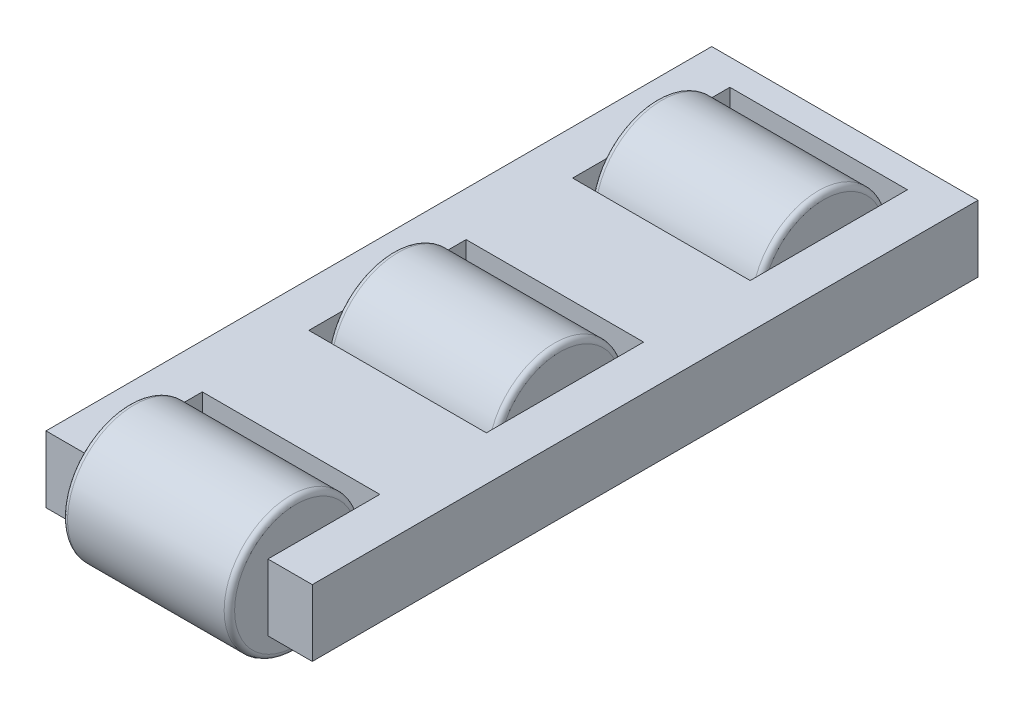
ISO-10303-21;
HEADER;
FILE_DESCRIPTION(('STEP AP214'),'2;1');
FILE_NAME('part.step','',(''),(''),'','','');
FILE_SCHEMA(('AUTOMOTIVE_DESIGN { 1 0 10303 214 1 1 1 1 }'));
ENDSEC;
DATA;
#1=APPLICATION_CONTEXT('core data for automotive mechanical design processes');
#2=APPLICATION_PROTOCOL_DEFINITION('international standard','automotive_design',2000,#1);
#3=PRODUCT_CONTEXT('',#1,'mechanical');
#4=PRODUCT('Part','Part','',(#3));
#5=PRODUCT_RELATED_PRODUCT_CATEGORY('part','',(#4));
#6=PRODUCT_DEFINITION_FORMATION('','',#4);
#7=PRODUCT_DEFINITION_CONTEXT('part definition',#1,'design');
#8=PRODUCT_DEFINITION('design','',#6,#7);
#9=PRODUCT_DEFINITION_SHAPE('','',#8);
#10=(LENGTH_UNIT() NAMED_UNIT(*) SI_UNIT(.MILLI.,.METRE.));
#11=(NAMED_UNIT(*) PLANE_ANGLE_UNIT() SI_UNIT($,.RADIAN.));
#12=(NAMED_UNIT(*) SI_UNIT($,.STERADIAN.) SOLID_ANGLE_UNIT());
#13=UNCERTAINTY_MEASURE_WITH_UNIT(LENGTH_MEASURE(1.E-05),#10,'distance_accuracy_value','');
#14=(GEOMETRIC_REPRESENTATION_CONTEXT(3) GLOBAL_UNCERTAINTY_ASSIGNED_CONTEXT((#13)) GLOBAL_UNIT_ASSIGNED_CONTEXT((#10,
#11,#12)) REPRESENTATION_CONTEXT('',''));
#15=CARTESIAN_POINT('',(0.,0.,0.));
#16=DIRECTION('',(0.,0.,1.));
#17=DIRECTION('',(1.,0.,0.));
#18=AXIS2_PLACEMENT_3D('',#15,#16,#17);
#19=CARTESIAN_POINT('',(15.9333333333333,6.35,57.15));
#20=DIRECTION('',(-1.,0.,0.));
#21=DIRECTION('',(0.,0.,1.));
#22=AXIS2_PLACEMENT_3D('',#19,#20,#21);
#23=PLANE('',#22);
#24=CARTESIAN_POINT('',(15.9333333333333,6.35,57.15));
#25=DIRECTION('',(-1.,0.,0.));
#26=DIRECTION('',(0.,0.,1.));
#27=AXIS2_PLACEMENT_3D('',#24,#25,#26);
#28=CIRCLE('',#27,11.7);
#29=CARTESIAN_POINT('',(15.9333333333333,6.35,68.85));
#30=VERTEX_POINT('',#29);
#31=EDGE_CURVE('E64',#30,#30,#28,.F.);
#32=ORIENTED_EDGE('',*,*,#31,.T.);
#33=EDGE_LOOP('',(#32));
#34=FACE_BOUND('',#33,.T.);
#35=ADVANCED_FACE('F57',(#34),#23,.F.);
#36=CARTESIAN_POINT('',(-51.85435781761,6.35,57.15));
#37=DIRECTION('',(1.,0.,0.));
#38=DIRECTION('',(0.,0.,-1.));
#39=AXIS2_PLACEMENT_3D('',#36,#37,#38);
#40=CYLINDRICAL_SURFACE('',#39,12.7);
#41=CARTESIAN_POINT('',(14.9333333333333,6.35,57.15));
#42=DIRECTION('',(-1.,0.,0.));
#43=DIRECTION('',(0.,0.,1.));
#44=AXIS2_PLACEMENT_3D('',#41,#42,#43);
#45=CIRCLE('',#44,12.7);
#46=CARTESIAN_POINT('',(14.9333333333333,6.35,69.85));
#47=VERTEX_POINT('',#46);
#48=EDGE_CURVE('E68',#47,#47,#45,.T.);
#49=ORIENTED_EDGE('',*,*,#48,.T.);
#50=EDGE_LOOP('',(#49));
#51=FACE_BOUND('',#50,.T.);
#52=CARTESIAN_POINT('',(-14.9333333333333,6.35,57.15));
#53=DIRECTION('',(1.,0.,0.));
#54=DIRECTION('',(0.,0.,-1.));
#55=AXIS2_PLACEMENT_3D('',#52,#53,#54);
#56=CIRCLE('',#55,12.7);
#57=CARTESIAN_POINT('',(-14.9333333333333,6.35,44.45));
#58=VERTEX_POINT('',#57);
#59=EDGE_CURVE('E72',#58,#58,#56,.T.);
#60=ORIENTED_EDGE('',*,*,#59,.T.);
#61=EDGE_LOOP('',(#60));
#62=FACE_BOUND('',#61,.T.);
#63=ADVANCED_FACE('F78',(#51,#62),#40,.T.);
#64=CARTESIAN_POINT('',(-15.9333333333333,0.,0.));
#65=DIRECTION('',(1.,0.,0.));
#66=DIRECTION('',(0.,0.,-1.));
#67=AXIS2_PLACEMENT_3D('',#64,#65,#66);
#68=PLANE('',#67);
#69=CARTESIAN_POINT('',(-15.9333333333333,6.35,57.15));
#70=DIRECTION('',(1.,0.,0.));
#71=DIRECTION('',(0.,0.,-1.));
#72=AXIS2_PLACEMENT_3D('',#69,#70,#71);
#73=CIRCLE('',#72,11.7);
#74=CARTESIAN_POINT('',(-15.9333333333333,6.35,45.45));
#75=VERTEX_POINT('',#74);
#76=EDGE_CURVE('E13',#75,#75,#73,.F.);
#77=ORIENTED_EDGE('',*,*,#76,.T.);
#78=EDGE_LOOP('',(#77));
#79=FACE_BOUND('',#78,.T.);
#80=ADVANCED_FACE('F86',(#79),#68,.F.);
#81=CARTESIAN_POINT('',(14.9333333333333,6.35,57.15));
#82=DIRECTION('',(-1.,0.,0.));
#83=DIRECTION('',(0.,0.,1.));
#84=AXIS2_PLACEMENT_3D('',#81,#82,#83);
#85=TOROIDAL_SURFACE('',#84,11.7,1.);
#86=ORIENTED_EDGE('',*,*,#31,.F.);
#87=EDGE_LOOP('',(#86));
#88=FACE_BOUND('',#87,.T.);
#89=ORIENTED_EDGE('',*,*,#48,.F.);
#90=EDGE_LOOP('',(#89));
#91=FACE_BOUND('',#90,.T.);
#92=ADVANCED_FACE('F81',(#88,#91),#85,.T.);
#93=CARTESIAN_POINT('',(-14.9333333333333,6.35,57.15));
#94=DIRECTION('',(1.,0.,0.));
#95=DIRECTION('',(0.,0.,-1.));
#96=AXIS2_PLACEMENT_3D('',#93,#94,#95);
#97=TOROIDAL_SURFACE('',#96,11.7,1.);
#98=ORIENTED_EDGE('',*,*,#76,.F.);
#99=EDGE_LOOP('',(#98));
#100=FACE_BOUND('',#99,.T.);
#101=ORIENTED_EDGE('',*,*,#59,.F.);
#102=EDGE_LOOP('',(#101));
#103=FACE_BOUND('',#102,.T.);
#104=ADVANCED_FACE('F59',(#100,#103),#97,.T.);
#105=CLOSED_SHELL('',(#35,#63,#80,#92,#104));
#106=MANIFOLD_SOLID_BREP('B2',#105);
#107=CARTESIAN_POINT('',(15.9333333333333,6.35,-43.5));
#108=DIRECTION('',(-1.,0.,0.));
#109=DIRECTION('',(0.,0.,1.));
#110=AXIS2_PLACEMENT_3D('',#107,#108,#109);
#111=PLANE('',#110);
#112=CARTESIAN_POINT('',(15.9333333333333,6.35,-43.5));
#113=DIRECTION('',(-1.,0.,0.));
#114=DIRECTION('',(0.,0.,1.));
#115=AXIS2_PLACEMENT_3D('',#112,#113,#114);
#116=CIRCLE('',#115,11.7);
#117=CARTESIAN_POINT('',(15.9333333333333,6.35,-31.8));
#118=VERTEX_POINT('',#117);
#119=EDGE_CURVE('E150',#118,#118,#116,.F.);
#120=ORIENTED_EDGE('',*,*,#119,.T.);
#121=EDGE_LOOP('',(#120));
#122=FACE_BOUND('',#121,.T.);
#123=ADVANCED_FACE('F143',(#122),#111,.F.);
#124=CARTESIAN_POINT('',(-51.85435781761,6.35,-43.5));
#125=DIRECTION('',(1.,0.,0.));
#126=DIRECTION('',(0.,0.,-1.));
#127=AXIS2_PLACEMENT_3D('',#124,#125,#126);
#128=CYLINDRICAL_SURFACE('',#127,12.7);
#129=CARTESIAN_POINT('',(14.9333333333333,6.35,-43.5));
#130=DIRECTION('',(-1.,0.,0.));
#131=DIRECTION('',(0.,0.,1.));
#132=AXIS2_PLACEMENT_3D('',#129,#130,#131);
#133=CIRCLE('',#132,12.7);
#134=CARTESIAN_POINT('',(14.9333333333333,6.35,-30.8));
#135=VERTEX_POINT('',#134);
#136=EDGE_CURVE('E154',#135,#135,#133,.T.);
#137=ORIENTED_EDGE('',*,*,#136,.T.);
#138=EDGE_LOOP('',(#137));
#139=FACE_BOUND('',#138,.T.);
#140=CARTESIAN_POINT('',(-14.9333333333333,6.35,-43.5));
#141=DIRECTION('',(1.,0.,0.));
#142=DIRECTION('',(0.,0.,-1.));
#143=AXIS2_PLACEMENT_3D('',#140,#141,#142);
#144=CIRCLE('',#143,12.7);
#145=CARTESIAN_POINT('',(-14.9333333333333,6.35,-56.2));
#146=VERTEX_POINT('',#145);
#147=EDGE_CURVE('E158',#146,#146,#144,.T.);
#148=ORIENTED_EDGE('',*,*,#147,.T.);
#149=EDGE_LOOP('',(#148));
#150=FACE_BOUND('',#149,.T.);
#151=ADVANCED_FACE('F164',(#139,#150),#128,.T.);
#152=CARTESIAN_POINT('',(-15.9333333333333,0.,0.));
#153=DIRECTION('',(1.,0.,0.));
#154=DIRECTION('',(0.,0.,-1.));
#155=AXIS2_PLACEMENT_3D('',#152,#153,#154);
#156=PLANE('',#155);
#157=CARTESIAN_POINT('',(-15.9333333333333,6.35,-43.5));
#158=DIRECTION('',(1.,0.,0.));
#159=DIRECTION('',(0.,0.,-1.));
#160=AXIS2_PLACEMENT_3D('',#157,#158,#159);
#161=CIRCLE('',#160,11.7);
#162=CARTESIAN_POINT('',(-15.9333333333333,6.35,-55.2));
#163=VERTEX_POINT('',#162);
#164=EDGE_CURVE('E56',#163,#163,#161,.F.);
#165=ORIENTED_EDGE('',*,*,#164,.T.);
#166=EDGE_LOOP('',(#165));
#167=FACE_BOUND('',#166,.T.);
#168=ADVANCED_FACE('F172',(#167),#156,.F.);
#169=CARTESIAN_POINT('',(14.9333333333333,6.35,-43.5));
#170=DIRECTION('',(-1.,0.,0.));
#171=DIRECTION('',(0.,0.,1.));
#172=AXIS2_PLACEMENT_3D('',#169,#170,#171);
#173=TOROIDAL_SURFACE('',#172,11.7,1.);
#174=ORIENTED_EDGE('',*,*,#119,.F.);
#175=EDGE_LOOP('',(#174));
#176=FACE_BOUND('',#175,.T.);
#177=ORIENTED_EDGE('',*,*,#136,.F.);
#178=EDGE_LOOP('',(#177));
#179=FACE_BOUND('',#178,.T.);
#180=ADVANCED_FACE('F167',(#176,#179),#173,.T.);
#181=CARTESIAN_POINT('',(-14.9333333333333,6.35,-43.5));
#182=DIRECTION('',(1.,0.,0.));
#183=DIRECTION('',(0.,0.,-1.));
#184=AXIS2_PLACEMENT_3D('',#181,#182,#183);
#185=TOROIDAL_SURFACE('',#184,11.7,1.);
#186=ORIENTED_EDGE('',*,*,#164,.F.);
#187=EDGE_LOOP('',(#186));
#188=FACE_BOUND('',#187,.T.);
#189=ORIENTED_EDGE('',*,*,#147,.F.);
#190=EDGE_LOOP('',(#189));
#191=FACE_BOUND('',#190,.T.);
#192=ADVANCED_FACE('F145',(#188,#191),#185,.T.);
#193=CLOSED_SHELL('',(#123,#151,#168,#180,#192));
#194=MANIFOLD_SOLID_BREP('B8',#193);
#195=CARTESIAN_POINT('',(15.9333333333333,6.35,6.825));
#196=DIRECTION('',(-1.,0.,0.));
#197=DIRECTION('',(0.,0.,1.));
#198=AXIS2_PLACEMENT_3D('',#195,#196,#197);
#199=PLANE('',#198);
#200=CARTESIAN_POINT('',(15.9333333333333,6.35,6.825));
#201=DIRECTION('',(-1.,0.,0.));
#202=DIRECTION('',(0.,0.,1.));
#203=AXIS2_PLACEMENT_3D('',#200,#201,#202);
#204=CIRCLE('',#203,11.7);
#205=CARTESIAN_POINT('',(15.9333333333333,6.35,18.525));
#206=VERTEX_POINT('',#205);
#207=EDGE_CURVE('E142',#206,#206,#204,.F.);
#208=ORIENTED_EDGE('',*,*,#207,.T.);
#209=EDGE_LOOP('',(#208));
#210=FACE_BOUND('',#209,.T.);
#211=ADVANCED_FACE('F228',(#210),#199,.F.);
#212=CARTESIAN_POINT('',(-51.85435781761,6.35,6.825));
#213=DIRECTION('',(1.,0.,0.));
#214=DIRECTION('',(0.,0.,-1.));
#215=AXIS2_PLACEMENT_3D('',#212,#213,#214);
#216=CYLINDRICAL_SURFACE('',#215,12.7);
#217=CARTESIAN_POINT('',(-14.9333333333333,6.35,6.825));
#218=DIRECTION('',(1.,0.,0.));
#219=DIRECTION('',(0.,0.,-1.));
#220=AXIS2_PLACEMENT_3D('',#217,#218,#219);
#221=CIRCLE('',#220,12.7);
#222=CARTESIAN_POINT('',(-14.9333333333333,6.35,-5.875));
#223=VERTEX_POINT('',#222);
#224=EDGE_CURVE('E239',#223,#223,#221,.T.);
#225=ORIENTED_EDGE('',*,*,#224,.T.);
#226=EDGE_LOOP('',(#225));
#227=FACE_BOUND('',#226,.T.);
#228=CARTESIAN_POINT('',(14.9333333333333,6.35,6.825));
#229=DIRECTION('',(-1.,0.,0.));
#230=DIRECTION('',(0.,0.,1.));
#231=AXIS2_PLACEMENT_3D('',#228,#229,#230);
#232=CIRCLE('',#231,12.7);
#233=CARTESIAN_POINT('',(14.9333333333333,6.35,19.525));
#234=VERTEX_POINT('',#233);
#235=EDGE_CURVE('E243',#234,#234,#232,.T.);
#236=ORIENTED_EDGE('',*,*,#235,.T.);
#237=EDGE_LOOP('',(#236));
#238=FACE_BOUND('',#237,.T.);
#239=ADVANCED_FACE('F249',(#227,#238),#216,.T.);
#240=CARTESIAN_POINT('',(-15.9333333333333,0.,0.));
#241=DIRECTION('',(1.,0.,0.));
#242=DIRECTION('',(0.,0.,-1.));
#243=AXIS2_PLACEMENT_3D('',#240,#241,#242);
#244=PLANE('',#243);
#245=CARTESIAN_POINT('',(-15.9333333333333,6.35,6.825));
#246=DIRECTION('',(1.,0.,0.));
#247=DIRECTION('',(0.,0.,-1.));
#248=AXIS2_PLACEMENT_3D('',#245,#246,#247);
#249=CIRCLE('',#248,11.7);
#250=CARTESIAN_POINT('',(-15.9333333333333,6.35,-4.875));
#251=VERTEX_POINT('',#250);
#252=EDGE_CURVE('E235',#251,#251,#249,.F.);
#253=ORIENTED_EDGE('',*,*,#252,.T.);
#254=EDGE_LOOP('',(#253));
#255=FACE_BOUND('',#254,.T.);
#256=ADVANCED_FACE('F257',(#255),#244,.F.);
#257=CARTESIAN_POINT('',(-14.9333333333333,6.35,6.825));
#258=DIRECTION('',(1.,0.,0.));
#259=DIRECTION('',(0.,0.,-1.));
#260=AXIS2_PLACEMENT_3D('',#257,#258,#259);
#261=TOROIDAL_SURFACE('',#260,11.7,1.);
#262=ORIENTED_EDGE('',*,*,#252,.F.);
#263=EDGE_LOOP('',(#262));
#264=FACE_BOUND('',#263,.T.);
#265=ORIENTED_EDGE('',*,*,#224,.F.);
#266=EDGE_LOOP('',(#265));
#267=FACE_BOUND('',#266,.T.);
#268=ADVANCED_FACE('F252',(#264,#267),#261,.T.);
#269=CARTESIAN_POINT('',(14.9333333333333,6.35,6.825));
#270=DIRECTION('',(-1.,0.,0.));
#271=DIRECTION('',(0.,0.,1.));
#272=AXIS2_PLACEMENT_3D('',#269,#270,#271);
#273=TOROIDAL_SURFACE('',#272,11.7,1.);
#274=ORIENTED_EDGE('',*,*,#207,.F.);
#275=EDGE_LOOP('',(#274));
#276=FACE_BOUND('',#275,.T.);
#277=ORIENTED_EDGE('',*,*,#235,.F.);
#278=EDGE_LOOP('',(#277));
#279=FACE_BOUND('',#278,.T.);
#280=ADVANCED_FACE('F230',(#276,#279),#273,.T.);
#281=CLOSED_SHELL('',(#211,#239,#256,#268,#280));
#282=MANIFOLD_SOLID_BREP('B51',#281);
#283=CARTESIAN_POINT('',(-25.4,12.7,63.5));
#284=DIRECTION('',(0.,0.,-1.));
#285=DIRECTION('',(-1.,0.,0.));
#286=AXIS2_PLACEMENT_3D('',#283,#284,#285);
#287=PLANE('',#286);
#288=DIRECTION('',(1.,0.,0.));
#289=VECTOR('',#288,1.);
#290=CARTESIAN_POINT('',(-25.4,12.7,63.5));
#291=LINE('',#290,#289);
#292=CARTESIAN_POINT('',(16.9333333333333,12.7,63.5));
#293=VERTEX_POINT('',#292);
#294=CARTESIAN_POINT('',(25.4,12.7,63.5));
#295=VERTEX_POINT('',#294);
#296=EDGE_CURVE('E516',#293,#295,#291,.T.);
#297=ORIENTED_EDGE('',*,*,#296,.F.);
#298=DIRECTION('',(0.,1.,0.));
#299=VECTOR('',#298,1.);
#300=CARTESIAN_POINT('',(16.9333333333333,-45.243243817294,63.5));
#301=LINE('',#300,#299);
#302=CARTESIAN_POINT('',(16.9333333333333,0.,63.5));
#303=VERTEX_POINT('',#302);
#304=EDGE_CURVE('E503',#303,#293,#301,.T.);
#305=ORIENTED_EDGE('',*,*,#304,.F.);
#306=DIRECTION('',(1.,0.,0.));
#307=VECTOR('',#306,1.);
#308=CARTESIAN_POINT('',(-25.4,0.,63.5));
#309=LINE('',#308,#307);
#310=CARTESIAN_POINT('',(25.4,0.,63.5));
#311=VERTEX_POINT('',#310);
#312=EDGE_CURVE('E527',#303,#311,#309,.T.);
#313=ORIENTED_EDGE('',*,*,#312,.T.);
#314=DIRECTION('',(0.,-1.,0.));
#315=VECTOR('',#314,1.);
#316=CARTESIAN_POINT('',(25.4,12.7,63.5));
#317=LINE('',#316,#315);
#318=EDGE_CURVE('E520',#295,#311,#317,.T.);
#319=ORIENTED_EDGE('',*,*,#318,.F.);
#320=EDGE_LOOP('',(#297,#305,#313,#319));
#321=FACE_BOUND('',#320,.T.);
#322=ADVANCED_FACE('F298',(#321),#287,.F.);
#323=CARTESIAN_POINT('',(25.4,12.7,63.5));
#324=DIRECTION('',(-1.,0.,0.));
#325=DIRECTION('',(0.,0.,1.));
#326=AXIS2_PLACEMENT_3D('',#323,#324,#325);
#327=PLANE('',#326);
#328=DIRECTION('',(0.,0.,-1.));
#329=VECTOR('',#328,1.);
#330=CARTESIAN_POINT('',(25.4,0.,63.5));
#331=LINE('',#330,#329);
#332=CARTESIAN_POINT('',(25.4,0.,-63.5));
#333=VERTEX_POINT('',#332);
#334=EDGE_CURVE('E507',#311,#333,#331,.T.);
#335=ORIENTED_EDGE('',*,*,#334,.T.);
#336=DIRECTION('',(0.,-1.,0.));
#337=VECTOR('',#336,1.);
#338=CARTESIAN_POINT('',(25.4,12.7,-63.5));
#339=LINE('',#338,#337);
#340=CARTESIAN_POINT('',(25.4,12.7,-63.5));
#341=VERTEX_POINT('',#340);
#342=EDGE_CURVE('E226',#341,#333,#339,.T.);
#343=ORIENTED_EDGE('',*,*,#342,.F.);
#344=DIRECTION('',(0.,0.,-1.));
#345=VECTOR('',#344,1.);
#346=CARTESIAN_POINT('',(25.4,12.7,63.5));
#347=LINE('',#346,#345);
#348=EDGE_CURVE('E508',#295,#341,#347,.T.);
#349=ORIENTED_EDGE('',*,*,#348,.F.);
#350=ORIENTED_EDGE('',*,*,#318,.T.);
#351=EDGE_LOOP('',(#335,#343,#349,#350));
#352=FACE_BOUND('',#351,.T.);
#353=ADVANCED_FACE('F300',(#352),#327,.F.);
#354=CARTESIAN_POINT('',(-25.4,12.7,-63.5));
#355=DIRECTION('',(0.,0.,1.));
#356=DIRECTION('',(1.,0.,0.));
#357=AXIS2_PLACEMENT_3D('',#354,#355,#356);
#358=PLANE('',#357);
#359=DIRECTION('',(-1.,0.,0.));
#360=VECTOR('',#359,1.);
#361=CARTESIAN_POINT('',(-25.4,0.,-63.5));
#362=LINE('',#361,#360);
#363=CARTESIAN_POINT('',(-25.4,0.,-63.5));
#364=VERTEX_POINT('',#363);
#365=EDGE_CURVE('E523',#333,#364,#362,.T.);
#366=ORIENTED_EDGE('',*,*,#365,.T.);
#367=DIRECTION('',(0.,-1.,0.));
#368=VECTOR('',#367,1.);
#369=CARTESIAN_POINT('',(-25.4,12.7,-63.5));
#370=LINE('',#369,#368);
#371=CARTESIAN_POINT('',(-25.4,12.7,-63.5));
#372=VERTEX_POINT('',#371);
#373=EDGE_CURVE('E306',#372,#364,#370,.T.);
#374=ORIENTED_EDGE('',*,*,#373,.F.);
#375=DIRECTION('',(-1.,0.,0.));
#376=VECTOR('',#375,1.);
#377=CARTESIAN_POINT('',(-25.4,12.7,-63.5));
#378=LINE('',#377,#376);
#379=EDGE_CURVE('E511',#341,#372,#378,.T.);
#380=ORIENTED_EDGE('',*,*,#379,.F.);
#381=ORIENTED_EDGE('',*,*,#342,.T.);
#382=EDGE_LOOP('',(#366,#374,#380,#381));
#383=FACE_BOUND('',#382,.T.);
#384=ADVANCED_FACE('F554',(#383),#358,.F.);
#385=CARTESIAN_POINT('',(-25.4,12.7,63.5));
#386=DIRECTION('',(1.,0.,0.));
#387=DIRECTION('',(0.,0.,-1.));
#388=AXIS2_PLACEMENT_3D('',#385,#386,#387);
#389=PLANE('',#388);
#390=DIRECTION('',(0.,0.,1.));
#391=VECTOR('',#390,1.);
#392=CARTESIAN_POINT('',(-25.4,0.,63.5));
#393=LINE('',#392,#391);
#394=CARTESIAN_POINT('',(-25.4,0.,63.5));
#395=VERTEX_POINT('',#394);
#396=EDGE_CURVE('E525',#364,#395,#393,.T.);
#397=ORIENTED_EDGE('',*,*,#396,.T.);
#398=DIRECTION('',(0.,-1.,0.));
#399=VECTOR('',#398,1.);
#400=CARTESIAN_POINT('',(-25.4,12.7,63.5));
#401=LINE('',#400,#399);
#402=CARTESIAN_POINT('',(-25.4,12.7,63.5));
#403=VERTEX_POINT('',#402);
#404=EDGE_CURVE('E532',#403,#395,#401,.T.);
#405=ORIENTED_EDGE('',*,*,#404,.F.);
#406=DIRECTION('',(0.,0.,1.));
#407=VECTOR('',#406,1.);
#408=CARTESIAN_POINT('',(-25.4,12.7,63.5));
#409=LINE('',#408,#407);
#410=EDGE_CURVE('E514',#372,#403,#409,.T.);
#411=ORIENTED_EDGE('',*,*,#410,.F.);
#412=ORIENTED_EDGE('',*,*,#373,.T.);
#413=EDGE_LOOP('',(#397,#405,#411,#412));
#414=FACE_BOUND('',#413,.T.);
#415=ADVANCED_FACE('F539',(#414),#389,.F.);
#416=CARTESIAN_POINT('',(-16.9333333333333,0.,63.5));
#417=VERTEX_POINT('',#416);
#418=EDGE_CURVE('E512',#395,#417,#309,.T.);
#419=ORIENTED_EDGE('',*,*,#418,.T.);
#420=DIRECTION('',(0.,1.,0.));
#421=VECTOR('',#420,1.);
#422=CARTESIAN_POINT('',(-16.9333333333333,-45.243243817294,63.5));
#423=LINE('',#422,#421);
#424=CARTESIAN_POINT('',(-16.9333333333333,12.7,63.5));
#425=VERTEX_POINT('',#424);
#426=EDGE_CURVE('E496',#417,#425,#423,.T.);
#427=ORIENTED_EDGE('',*,*,#426,.T.);
#428=EDGE_CURVE('E517',#403,#425,#291,.T.);
#429=ORIENTED_EDGE('',*,*,#428,.F.);
#430=ORIENTED_EDGE('',*,*,#404,.T.);
#431=EDGE_LOOP('',(#419,#427,#429,#430));
#432=FACE_BOUND('',#431,.T.);
#433=ADVANCED_FACE('F546',(#432),#287,.F.);
#434=CARTESIAN_POINT('',(0.,12.7,0.));
#435=DIRECTION('',(0.,-1.,0.));
#436=DIRECTION('',(0.,0.,-1.));
#437=AXIS2_PLACEMENT_3D('',#434,#435,#436);
#438=PLANE('',#437);
#439=DIRECTION('',(0.,0.,-1.));
#440=VECTOR('',#439,1.);
#441=CARTESIAN_POINT('',(16.9333333333333,12.7,-8.175));
#442=LINE('',#441,#440);
#443=CARTESIAN_POINT('',(16.9333333333333,12.7,21.825));
#444=VERTEX_POINT('',#443);
#445=CARTESIAN_POINT('',(16.9333333333333,12.7,-8.175));
#446=VERTEX_POINT('',#445);
#447=EDGE_CURVE('E437',#444,#446,#442,.T.);
#448=ORIENTED_EDGE('',*,*,#447,.F.);
#449=DIRECTION('',(1.,0.,0.));
#450=VECTOR('',#449,1.);
#451=CARTESIAN_POINT('',(-16.9333333333333,12.7,21.825));
#452=LINE('',#451,#450);
#453=CARTESIAN_POINT('',(-16.9333333333333,12.7,21.825));
#454=VERTEX_POINT('',#453);
#455=EDGE_CURVE('E430',#454,#444,#452,.T.);
#456=ORIENTED_EDGE('',*,*,#455,.F.);
#457=DIRECTION('',(0.,0.,1.));
#458=VECTOR('',#457,1.);
#459=CARTESIAN_POINT('',(-16.9333333333333,12.7,-8.175));
#460=LINE('',#459,#458);
#461=CARTESIAN_POINT('',(-16.9333333333333,12.7,-8.175));
#462=VERTEX_POINT('',#461);
#463=EDGE_CURVE('E441',#462,#454,#460,.T.);
#464=ORIENTED_EDGE('',*,*,#463,.F.);
#465=DIRECTION('',(-1.,0.,0.));
#466=VECTOR('',#465,1.);
#467=CARTESIAN_POINT('',(-16.9333333333333,12.7,-8.175));
#468=LINE('',#467,#466);
#469=EDGE_CURVE('E313',#446,#462,#468,.T.);
#470=ORIENTED_EDGE('',*,*,#469,.F.);
#471=EDGE_LOOP('',(#448,#456,#464,#470));
#472=FACE_BOUND('',#471,.T.);
#473=DIRECTION('',(0.,0.,1.));
#474=VECTOR('',#473,1.);
#475=CARTESIAN_POINT('',(-16.9333333333333,12.7,-28.5));
#476=LINE('',#475,#474);
#477=CARTESIAN_POINT('',(-16.9333333333333,12.7,-58.5));
#478=VERTEX_POINT('',#477);
#479=CARTESIAN_POINT('',(-16.9333333333333,12.7,-28.5));
#480=VERTEX_POINT('',#479);
#481=EDGE_CURVE('E454',#478,#480,#476,.T.);
#482=ORIENTED_EDGE('',*,*,#481,.F.);
#483=DIRECTION('',(-1.,0.,0.));
#484=VECTOR('',#483,1.);
#485=CARTESIAN_POINT('',(16.9333333333333,12.7,-58.5));
#486=LINE('',#485,#484);
#487=CARTESIAN_POINT('',(16.9333333333333,12.7,-58.5));
#488=VERTEX_POINT('',#487);
#489=EDGE_CURVE('E457',#488,#478,#486,.T.);
#490=ORIENTED_EDGE('',*,*,#489,.F.);
#491=DIRECTION('',(0.,0.,-1.));
#492=VECTOR('',#491,1.);
#493=CARTESIAN_POINT('',(16.9333333333333,12.7,-28.5));
#494=LINE('',#493,#492);
#495=CARTESIAN_POINT('',(16.9333333333333,12.7,-28.5));
#496=VERTEX_POINT('',#495);
#497=EDGE_CURVE('E460',#496,#488,#494,.T.);
#498=ORIENTED_EDGE('',*,*,#497,.F.);
#499=DIRECTION('',(1.,0.,0.));
#500=VECTOR('',#499,1.);
#501=CARTESIAN_POINT('',(16.9333333333333,12.7,-28.5));
#502=LINE('',#501,#500);
#503=EDGE_CURVE('E321',#480,#496,#502,.T.);
#504=ORIENTED_EDGE('',*,*,#503,.F.);
#505=EDGE_LOOP('',(#482,#490,#498,#504));
#506=FACE_BOUND('',#505,.T.);
#507=DIRECTION('',(-1.,0.,0.));
#508=VECTOR('',#507,1.);
#509=CARTESIAN_POINT('',(16.9333333333333,12.7,42.15));
#510=LINE('',#509,#508);
#511=CARTESIAN_POINT('',(16.9333333333333,12.7,42.15));
#512=VERTEX_POINT('',#511);
#513=CARTESIAN_POINT('',(-16.9333333333333,12.7,42.15));
#514=VERTEX_POINT('',#513);
#515=EDGE_CURVE('E485',#512,#514,#510,.T.);
#516=ORIENTED_EDGE('',*,*,#515,.F.);
#517=DIRECTION('',(0.,0.,-1.));
#518=VECTOR('',#517,1.);
#519=CARTESIAN_POINT('',(16.9333333333333,12.7,63.5));
#520=LINE('',#519,#518);
#521=EDGE_CURVE('E451',#293,#512,#520,.T.);
#522=ORIENTED_EDGE('',*,*,#521,.F.);
#523=ORIENTED_EDGE('',*,*,#296,.T.);
#524=ORIENTED_EDGE('',*,*,#348,.T.);
#525=ORIENTED_EDGE('',*,*,#379,.T.);
#526=ORIENTED_EDGE('',*,*,#410,.T.);
#527=ORIENTED_EDGE('',*,*,#428,.T.);
#528=DIRECTION('',(0.,0.,1.));
#529=VECTOR('',#528,1.);
#530=CARTESIAN_POINT('',(-16.9333333333333,12.7,63.5));
#531=LINE('',#530,#529);
#532=EDGE_CURVE('E482',#514,#425,#531,.T.);
#533=ORIENTED_EDGE('',*,*,#532,.F.);
#534=EDGE_LOOP('',(#516,#522,#523,#524,#525,#526,#527,#533));
#535=FACE_BOUND('',#534,.T.);
#536=ADVANCED_FACE('F551',(#472,#506,#535),#438,.F.);
#537=CARTESIAN_POINT('',(0.,0.,0.));
#538=DIRECTION('',(0.,-1.,0.));
#539=DIRECTION('',(0.,0.,-1.));
#540=AXIS2_PLACEMENT_3D('',#537,#538,#539);
#541=PLANE('',#540);
#542=DIRECTION('',(1.,0.,0.));
#543=VECTOR('',#542,1.);
#544=CARTESIAN_POINT('',(-16.9333333333333,0.,21.825));
#545=LINE('',#544,#543);
#546=CARTESIAN_POINT('',(-16.9333333333333,0.,21.825));
#547=VERTEX_POINT('',#546);
#548=CARTESIAN_POINT('',(16.9333333333333,0.,21.825));
#549=VERTEX_POINT('',#548);
#550=EDGE_CURVE('E427',#547,#549,#545,.T.);
#551=ORIENTED_EDGE('',*,*,#550,.T.);
#552=DIRECTION('',(0.,0.,-1.));
#553=VECTOR('',#552,1.);
#554=CARTESIAN_POINT('',(16.9333333333333,0.,-8.175));
#555=LINE('',#554,#553);
#556=CARTESIAN_POINT('',(16.9333333333333,0.,-8.175));
#557=VERTEX_POINT('',#556);
#558=EDGE_CURVE('E413',#549,#557,#555,.T.);
#559=ORIENTED_EDGE('',*,*,#558,.T.);
#560=DIRECTION('',(-1.,0.,0.));
#561=VECTOR('',#560,1.);
#562=CARTESIAN_POINT('',(-16.9333333333333,0.,-8.175));
#563=LINE('',#562,#561);
#564=CARTESIAN_POINT('',(-16.9333333333333,0.,-8.175));
#565=VERTEX_POINT('',#564);
#566=EDGE_CURVE('E446',#557,#565,#563,.T.);
#567=ORIENTED_EDGE('',*,*,#566,.T.);
#568=DIRECTION('',(0.,0.,1.));
#569=VECTOR('',#568,1.);
#570=CARTESIAN_POINT('',(-16.9333333333333,0.,-8.175));
#571=LINE('',#570,#569);
#572=EDGE_CURVE('E435',#565,#547,#571,.T.);
#573=ORIENTED_EDGE('',*,*,#572,.T.);
#574=EDGE_LOOP('',(#551,#559,#567,#573));
#575=FACE_BOUND('',#574,.T.);
#576=DIRECTION('',(-1.,0.,0.));
#577=VECTOR('',#576,1.);
#578=CARTESIAN_POINT('',(16.9333333333333,0.,-58.5));
#579=LINE('',#578,#577);
#580=CARTESIAN_POINT('',(16.9333333333333,0.,-58.5));
#581=VERTEX_POINT('',#580);
#582=CARTESIAN_POINT('',(-16.9333333333333,0.,-58.5));
#583=VERTEX_POINT('',#582);
#584=EDGE_CURVE('E453',#581,#583,#579,.T.);
#585=ORIENTED_EDGE('',*,*,#584,.T.);
#586=DIRECTION('',(0.,0.,1.));
#587=VECTOR('',#586,1.);
#588=CARTESIAN_POINT('',(-16.9333333333333,0.,-28.5));
#589=LINE('',#588,#587);
#590=CARTESIAN_POINT('',(-16.9333333333333,0.,-28.5));
#591=VERTEX_POINT('',#590);
#592=EDGE_CURVE('E475',#583,#591,#589,.T.);
#593=ORIENTED_EDGE('',*,*,#592,.T.);
#594=DIRECTION('',(1.,0.,0.));
#595=VECTOR('',#594,1.);
#596=CARTESIAN_POINT('',(16.9333333333333,0.,-28.5));
#597=LINE('',#596,#595);
#598=CARTESIAN_POINT('',(16.9333333333333,0.,-28.5));
#599=VERTEX_POINT('',#598);
#600=EDGE_CURVE('E471',#591,#599,#597,.T.);
#601=ORIENTED_EDGE('',*,*,#600,.T.);
#602=DIRECTION('',(0.,0.,-1.));
#603=VECTOR('',#602,1.);
#604=CARTESIAN_POINT('',(16.9333333333333,0.,-28.5));
#605=LINE('',#604,#603);
#606=EDGE_CURVE('E466',#599,#581,#605,.T.);
#607=ORIENTED_EDGE('',*,*,#606,.T.);
#608=EDGE_LOOP('',(#585,#593,#601,#607));
#609=FACE_BOUND('',#608,.T.);
#610=DIRECTION('',(0.,0.,-1.));
#611=VECTOR('',#610,1.);
#612=CARTESIAN_POINT('',(16.9333333333333,0.,63.5));
#613=LINE('',#612,#611);
#614=CARTESIAN_POINT('',(16.9333333333333,0.,42.15));
#615=VERTEX_POINT('',#614);
#616=EDGE_CURVE('E484',#303,#615,#613,.T.);
#617=ORIENTED_EDGE('',*,*,#616,.T.);
#618=DIRECTION('',(-1.,0.,0.));
#619=VECTOR('',#618,1.);
#620=CARTESIAN_POINT('',(16.9333333333333,0.,42.15));
#621=LINE('',#620,#619);
#622=CARTESIAN_POINT('',(-16.9333333333333,0.,42.15));
#623=VERTEX_POINT('',#622);
#624=EDGE_CURVE('E498',#615,#623,#621,.T.);
#625=ORIENTED_EDGE('',*,*,#624,.T.);
#626=DIRECTION('',(0.,0.,1.));
#627=VECTOR('',#626,1.);
#628=CARTESIAN_POINT('',(-16.9333333333333,0.,63.5));
#629=LINE('',#628,#627);
#630=EDGE_CURVE('E493',#623,#417,#629,.T.);
#631=ORIENTED_EDGE('',*,*,#630,.T.);
#632=ORIENTED_EDGE('',*,*,#418,.F.);
#633=ORIENTED_EDGE('',*,*,#396,.F.);
#634=ORIENTED_EDGE('',*,*,#365,.F.);
#635=ORIENTED_EDGE('',*,*,#334,.F.);
#636=ORIENTED_EDGE('',*,*,#312,.F.);
#637=EDGE_LOOP('',(#617,#625,#631,#632,#633,#634,#635,#636));
#638=FACE_BOUND('',#637,.T.);
#639=ADVANCED_FACE('F433',(#575,#609,#638),#541,.T.);
#640=CARTESIAN_POINT('',(16.9333333333333,-45.243243817294,63.5));
#641=DIRECTION('',(1.,0.,0.));
#642=DIRECTION('',(0.,0.,-1.));
#643=AXIS2_PLACEMENT_3D('',#640,#641,#642);
#644=PLANE('',#643);
#645=ORIENTED_EDGE('',*,*,#304,.T.);
#646=ORIENTED_EDGE('',*,*,#521,.T.);
#647=DIRECTION('',(0.,1.,0.));
#648=VECTOR('',#647,1.);
#649=CARTESIAN_POINT('',(16.9333333333333,-45.243243817294,42.15));
#650=LINE('',#649,#648);
#651=EDGE_CURVE('E492',#615,#512,#650,.T.);
#652=ORIENTED_EDGE('',*,*,#651,.F.);
#653=ORIENTED_EDGE('',*,*,#616,.F.);
#654=EDGE_LOOP('',(#645,#646,#652,#653));
#655=FACE_BOUND('',#654,.T.);
#656=ADVANCED_FACE('F563',(#655),#644,.F.);
#657=CARTESIAN_POINT('',(16.9333333333333,-45.243243817294,42.15));
#658=DIRECTION('',(0.,0.,-1.));
#659=DIRECTION('',(-1.,0.,0.));
#660=AXIS2_PLACEMENT_3D('',#657,#658,#659);
#661=PLANE('',#660);
#662=ORIENTED_EDGE('',*,*,#651,.T.);
#663=ORIENTED_EDGE('',*,*,#515,.T.);
#664=DIRECTION('',(0.,1.,0.));
#665=VECTOR('',#664,1.);
#666=CARTESIAN_POINT('',(-16.9333333333333,-45.243243817294,42.15));
#667=LINE('',#666,#665);
#668=EDGE_CURVE('E497',#623,#514,#667,.T.);
#669=ORIENTED_EDGE('',*,*,#668,.F.);
#670=ORIENTED_EDGE('',*,*,#624,.F.);
#671=EDGE_LOOP('',(#662,#663,#669,#670));
#672=FACE_BOUND('',#671,.T.);
#673=ADVANCED_FACE('F567',(#672),#661,.F.);
#674=CARTESIAN_POINT('',(-16.9333333333333,-45.243243817294,63.5));
#675=DIRECTION('',(-1.,0.,0.));
#676=DIRECTION('',(0.,0.,1.));
#677=AXIS2_PLACEMENT_3D('',#674,#675,#676);
#678=PLANE('',#677);
#679=ORIENTED_EDGE('',*,*,#668,.T.);
#680=ORIENTED_EDGE('',*,*,#532,.T.);
#681=ORIENTED_EDGE('',*,*,#426,.F.);
#682=ORIENTED_EDGE('',*,*,#630,.F.);
#683=EDGE_LOOP('',(#679,#680,#681,#682));
#684=FACE_BOUND('',#683,.T.);
#685=ADVANCED_FACE('F569',(#684),#678,.F.);
#686=CARTESIAN_POINT('',(16.9333333333333,-45.243243817294,-58.5));
#687=DIRECTION('',(0.,0.,-1.));
#688=DIRECTION('',(-1.,0.,0.));
#689=AXIS2_PLACEMENT_3D('',#686,#687,#688);
#690=PLANE('',#689);
#691=DIRECTION('',(0.,1.,0.));
#692=VECTOR('',#691,1.);
#693=CARTESIAN_POINT('',(16.9333333333333,-45.243243817294,-58.5));
#694=LINE('',#693,#692);
#695=EDGE_CURVE('E469',#581,#488,#694,.T.);
#696=ORIENTED_EDGE('',*,*,#695,.T.);
#697=ORIENTED_EDGE('',*,*,#489,.T.);
#698=DIRECTION('',(0.,1.,0.));
#699=VECTOR('',#698,1.);
#700=CARTESIAN_POINT('',(-16.9333333333333,-45.243243817294,-58.5));
#701=LINE('',#700,#699);
#702=EDGE_CURVE('E465',#583,#478,#701,.T.);
#703=ORIENTED_EDGE('',*,*,#702,.F.);
#704=ORIENTED_EDGE('',*,*,#584,.F.);
#705=EDGE_LOOP('',(#696,#697,#703,#704));
#706=FACE_BOUND('',#705,.T.);
#707=ADVANCED_FACE('F571',(#706),#690,.F.);
#708=CARTESIAN_POINT('',(-16.9333333333333,-45.243243817294,-28.5));
#709=DIRECTION('',(-1.,0.,0.));
#710=DIRECTION('',(0.,0.,1.));
#711=AXIS2_PLACEMENT_3D('',#708,#709,#710);
#712=PLANE('',#711);
#713=ORIENTED_EDGE('',*,*,#702,.T.);
#714=ORIENTED_EDGE('',*,*,#481,.T.);
#715=DIRECTION('',(0.,1.,0.));
#716=VECTOR('',#715,1.);
#717=CARTESIAN_POINT('',(-16.9333333333333,-45.243243817294,-28.5));
#718=LINE('',#717,#716);
#719=EDGE_CURVE('E474',#591,#480,#718,.T.);
#720=ORIENTED_EDGE('',*,*,#719,.F.);
#721=ORIENTED_EDGE('',*,*,#592,.F.);
#722=EDGE_LOOP('',(#713,#714,#720,#721));
#723=FACE_BOUND('',#722,.T.);
#724=ADVANCED_FACE('F577',(#723),#712,.F.);
#725=CARTESIAN_POINT('',(16.9333333333333,-45.243243817294,-28.5));
#726=DIRECTION('',(0.,0.,1.));
#727=DIRECTION('',(1.,0.,0.));
#728=AXIS2_PLACEMENT_3D('',#725,#726,#727);
#729=PLANE('',#728);
#730=ORIENTED_EDGE('',*,*,#719,.T.);
#731=ORIENTED_EDGE('',*,*,#503,.T.);
#732=DIRECTION('',(0.,1.,0.));
#733=VECTOR('',#732,1.);
#734=CARTESIAN_POINT('',(16.9333333333333,-45.243243817294,-28.5));
#735=LINE('',#734,#733);
#736=EDGE_CURVE('E470',#599,#496,#735,.T.);
#737=ORIENTED_EDGE('',*,*,#736,.F.);
#738=ORIENTED_EDGE('',*,*,#600,.F.);
#739=EDGE_LOOP('',(#730,#731,#737,#738));
#740=FACE_BOUND('',#739,.T.);
#741=ADVANCED_FACE('F660',(#740),#729,.F.);
#742=CARTESIAN_POINT('',(16.9333333333333,-45.243243817294,-28.5));
#743=DIRECTION('',(1.,0.,0.));
#744=DIRECTION('',(0.,0.,-1.));
#745=AXIS2_PLACEMENT_3D('',#742,#743,#744);
#746=PLANE('',#745);
#747=ORIENTED_EDGE('',*,*,#736,.T.);
#748=ORIENTED_EDGE('',*,*,#497,.T.);
#749=ORIENTED_EDGE('',*,*,#695,.F.);
#750=ORIENTED_EDGE('',*,*,#606,.F.);
#751=EDGE_LOOP('',(#747,#748,#749,#750));
#752=FACE_BOUND('',#751,.T.);
#753=ADVANCED_FACE('F669',(#752),#746,.F.);
#754=CARTESIAN_POINT('',(-16.9333333333333,-45.243243817294,21.825));
#755=DIRECTION('',(0.,0.,1.));
#756=DIRECTION('',(1.,0.,0.));
#757=AXIS2_PLACEMENT_3D('',#754,#755,#756);
#758=PLANE('',#757);
#759=DIRECTION('',(0.,1.,0.));
#760=VECTOR('',#759,1.);
#761=CARTESIAN_POINT('',(-16.9333333333333,-45.243243817294,21.825));
#762=LINE('',#761,#760);
#763=EDGE_CURVE('E444',#547,#454,#762,.T.);
#764=ORIENTED_EDGE('',*,*,#763,.T.);
#765=ORIENTED_EDGE('',*,*,#455,.T.);
#766=DIRECTION('',(0.,1.,0.));
#767=VECTOR('',#766,1.);
#768=CARTESIAN_POINT('',(16.9333333333333,-45.243243817294,21.825));
#769=LINE('',#768,#767);
#770=EDGE_CURVE('E417',#549,#444,#769,.T.);
#771=ORIENTED_EDGE('',*,*,#770,.F.);
#772=ORIENTED_EDGE('',*,*,#550,.F.);
#773=EDGE_LOOP('',(#764,#765,#771,#772));
#774=FACE_BOUND('',#773,.T.);
#775=ADVANCED_FACE('F426',(#774),#758,.F.);
#776=CARTESIAN_POINT('',(16.9333333333333,-45.243243817294,-8.175));
#777=DIRECTION('',(1.,0.,0.));
#778=DIRECTION('',(0.,0.,-1.));
#779=AXIS2_PLACEMENT_3D('',#776,#777,#778);
#780=PLANE('',#779);
#781=ORIENTED_EDGE('',*,*,#770,.T.);
#782=ORIENTED_EDGE('',*,*,#447,.T.);
#783=DIRECTION('',(0.,1.,0.));
#784=VECTOR('',#783,1.);
#785=CARTESIAN_POINT('',(16.9333333333333,-45.243243817294,-8.175));
#786=LINE('',#785,#784);
#787=EDGE_CURVE('E419',#557,#446,#786,.T.);
#788=ORIENTED_EDGE('',*,*,#787,.F.);
#789=ORIENTED_EDGE('',*,*,#558,.F.);
#790=EDGE_LOOP('',(#781,#782,#788,#789));
#791=FACE_BOUND('',#790,.T.);
#792=ADVANCED_FACE('F415',(#791),#780,.F.);
#793=CARTESIAN_POINT('',(-16.9333333333333,-45.243243817294,-8.175));
#794=DIRECTION('',(0.,0.,-1.));
#795=DIRECTION('',(-1.,0.,0.));
#796=AXIS2_PLACEMENT_3D('',#793,#794,#795);
#797=PLANE('',#796);
#798=ORIENTED_EDGE('',*,*,#787,.T.);
#799=ORIENTED_EDGE('',*,*,#469,.T.);
#800=DIRECTION('',(0.,1.,0.));
#801=VECTOR('',#800,1.);
#802=CARTESIAN_POINT('',(-16.9333333333333,-45.243243817294,-8.175));
#803=LINE('',#802,#801);
#804=EDGE_CURVE('E445',#565,#462,#803,.T.);
#805=ORIENTED_EDGE('',*,*,#804,.F.);
#806=ORIENTED_EDGE('',*,*,#566,.F.);
#807=EDGE_LOOP('',(#798,#799,#805,#806));
#808=FACE_BOUND('',#807,.T.);
#809=ADVANCED_FACE('F692',(#808),#797,.F.);
#810=CARTESIAN_POINT('',(-16.9333333333333,-45.243243817294,-8.175));
#811=DIRECTION('',(-1.,0.,0.));
#812=DIRECTION('',(0.,0.,1.));
#813=AXIS2_PLACEMENT_3D('',#810,#811,#812);
#814=PLANE('',#813);
#815=ORIENTED_EDGE('',*,*,#804,.T.);
#816=ORIENTED_EDGE('',*,*,#463,.T.);
#817=ORIENTED_EDGE('',*,*,#763,.F.);
#818=ORIENTED_EDGE('',*,*,#572,.F.);
#819=EDGE_LOOP('',(#815,#816,#817,#818));
#820=FACE_BOUND('',#819,.T.);
#821=ADVANCED_FACE('F700',(#820),#814,.F.);
#822=CLOSED_SHELL('',(#322,#353,#384,#415,#433,#536,#639,#656,#673,#685,#707,#724,#741,#753,
#775,#792,#809,#821));
#823=MANIFOLD_SOLID_BREP('B137',#822);
#824=ADVANCED_BREP_SHAPE_REPRESENTATION('',(#18,#106,#194,#282,#823),#14);
#825=SHAPE_DEFINITION_REPRESENTATION(#9,#824);
ENDSEC;
END-ISO-10303-21;
